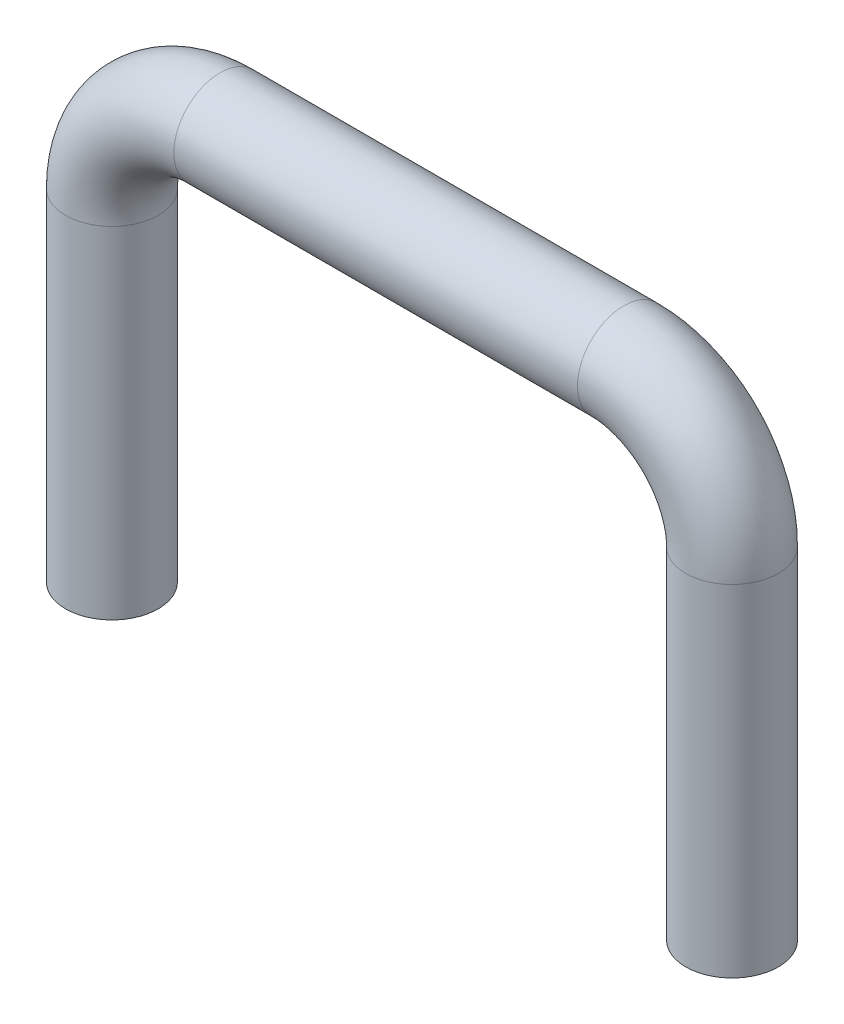
ISO-10303-21;
HEADER;
FILE_DESCRIPTION(('STEP AP214'),'2;1');
FILE_NAME('part.step','',(''),(''),'','','');
FILE_SCHEMA(('AUTOMOTIVE_DESIGN { 1 0 10303 214 1 1 1 1 }'));
ENDSEC;
DATA;
#1=APPLICATION_CONTEXT('core data for automotive mechanical design processes');
#2=APPLICATION_PROTOCOL_DEFINITION('international standard','automotive_design',2000,#1);
#3=PRODUCT_CONTEXT('',#1,'mechanical');
#4=PRODUCT('Part','Part','',(#3));
#5=PRODUCT_RELATED_PRODUCT_CATEGORY('part','',(#4));
#6=PRODUCT_DEFINITION_FORMATION('','',#4);
#7=PRODUCT_DEFINITION_CONTEXT('part definition',#1,'design');
#8=PRODUCT_DEFINITION('design','',#6,#7);
#9=PRODUCT_DEFINITION_SHAPE('','',#8);
#10=(LENGTH_UNIT() NAMED_UNIT(*) SI_UNIT(.MILLI.,.METRE.));
#11=(NAMED_UNIT(*) PLANE_ANGLE_UNIT() SI_UNIT($,.RADIAN.));
#12=(NAMED_UNIT(*) SI_UNIT($,.STERADIAN.) SOLID_ANGLE_UNIT());
#13=UNCERTAINTY_MEASURE_WITH_UNIT(LENGTH_MEASURE(1.E-05),#10,'distance_accuracy_value','');
#14=(GEOMETRIC_REPRESENTATION_CONTEXT(3) GLOBAL_UNCERTAINTY_ASSIGNED_CONTEXT((#13)) GLOBAL_UNIT_ASSIGNED_CONTEXT((#10,
#11,#12)) REPRESENTATION_CONTEXT('',''));
#15=CARTESIAN_POINT('',(0.,0.,0.));
#16=DIRECTION('',(0.,0.,1.));
#17=DIRECTION('',(1.,0.,0.));
#18=AXIS2_PLACEMENT_3D('',#15,#16,#17);
#19=CARTESIAN_POINT('',(-15.8999,0.,0.));
#20=DIRECTION('',(0.,1.,0.));
#21=DIRECTION('',(0.,0.,1.));
#22=AXIS2_PLACEMENT_3D('',#19,#20,#21);
#23=PLANE('',#22);
#24=CARTESIAN_POINT('',(-15.8999,0.,0.));
#25=DIRECTION('',(0.,1.,0.));
#26=DIRECTION('',(0.,0.,1.));
#27=AXIS2_PLACEMENT_3D('',#24,#25,#26);
#28=CIRCLE('',#27,2.3749);
#29=CARTESIAN_POINT('',(-15.8999,0.,2.3749));
#30=VERTEX_POINT('',#29);
#31=EDGE_CURVE('E45',#30,#30,#28,.T.);
#32=ORIENTED_EDGE('',*,*,#31,.F.);
#33=EDGE_LOOP('',(#32));
#34=FACE_BOUND('',#33,.T.);
#35=ADVANCED_FACE('F33',(#34),#23,.F.);
#36=CARTESIAN_POINT('',(-15.8999,0.,0.));
#37=DIRECTION('',(0.,1.,0.));
#38=DIRECTION('',(0.,0.,1.));
#39=AXIS2_PLACEMENT_3D('',#36,#37,#38);
#40=CYLINDRICAL_SURFACE('',#39,2.3749);
#41=CARTESIAN_POINT('',(-15.8999,17.4752,0.));
#42=DIRECTION('',(0.,1.,0.));
#43=DIRECTION('',(0.,0.,1.));
#44=AXIS2_PLACEMENT_3D('',#41,#42,#43);
#45=CIRCLE('',#44,2.3749);
#46=CARTESIAN_POINT('',(-18.2748,17.4752,0.));
#47=VERTEX_POINT('',#46);
#48=EDGE_CURVE('E40',#47,#47,#45,.T.);
#49=ORIENTED_EDGE('',*,*,#48,.F.);
#50=EDGE_LOOP('',(#49));
#51=FACE_BOUND('',#50,.T.);
#52=ORIENTED_EDGE('',*,*,#31,.T.);
#53=EDGE_LOOP('',(#52));
#54=FACE_BOUND('',#53,.T.);
#55=ADVANCED_FACE('F65',(#51,#54),#40,.T.);
#56=CARTESIAN_POINT('',(-10.35,17.4752,0.));
#57=DIRECTION('',(0.,0.,-1.));
#58=DIRECTION('',(-1.,0.,0.));
#59=AXIS2_PLACEMENT_3D('',#56,#57,#58);
#60=TOROIDAL_SURFACE('',#59,5.54990000000001,2.3749);
#61=CARTESIAN_POINT('',(-10.35,23.0251,0.));
#62=DIRECTION('',(1.,0.,0.));
#63=DIRECTION('',(0.,0.,1.));
#64=AXIS2_PLACEMENT_3D('',#61,#62,#63);
#65=CIRCLE('',#64,2.3749);
#66=CARTESIAN_POINT('',(-10.35,25.4,0.));
#67=VERTEX_POINT('',#66);
#68=EDGE_CURVE('E11',#67,#67,#65,.T.);
#69=CARTESIAN_POINT('',(-10.35,17.4752,0.));
#70=DIRECTION('',(0.,0.,-1.));
#71=DIRECTION('',(-1.,0.,0.));
#72=AXIS2_PLACEMENT_3D('',#69,#70,#71);
#73=CIRCLE('',#72,7.9248);
#74=EDGE_CURVE('',#47,#67,#73,.T.);
#75=ORIENTED_EDGE('',*,*,#48,.T.);
#76=ORIENTED_EDGE('',*,*,#68,.F.);
#77=ORIENTED_EDGE('',*,*,#74,.T.);
#78=ORIENTED_EDGE('',*,*,#74,.F.);
#79=EDGE_LOOP('',(#75,#77,#76,#78));
#80=FACE_BOUND('',#79,.T.);
#81=ADVANCED_FACE('F63',(#80),#60,.T.);
#82=CARTESIAN_POINT('',(-10.35,23.0251,0.));
#83=DIRECTION('',(1.,0.,0.));
#84=DIRECTION('',(0.,0.,-1.));
#85=AXIS2_PLACEMENT_3D('',#82,#83,#84);
#86=CYLINDRICAL_SURFACE('',#85,2.3749);
#87=ORIENTED_EDGE('',*,*,#68,.T.);
#88=EDGE_LOOP('',(#87));
#89=FACE_BOUND('',#88,.T.);
#90=CARTESIAN_POINT('',(10.35,23.0251,0.));
#91=DIRECTION('',(1.,0.,0.));
#92=DIRECTION('',(0.,0.,1.));
#93=AXIS2_PLACEMENT_3D('',#90,#91,#92);
#94=CIRCLE('',#93,2.3749);
#95=CARTESIAN_POINT('',(10.35,25.4,0.));
#96=VERTEX_POINT('',#95);
#97=EDGE_CURVE('E55',#96,#96,#94,.T.);
#98=ORIENTED_EDGE('',*,*,#97,.F.);
#99=EDGE_LOOP('',(#98));
#100=FACE_BOUND('',#99,.T.);
#101=ADVANCED_FACE('F73',(#89,#100),#86,.T.);
#102=CARTESIAN_POINT('',(15.8999,0.,0.));
#103=DIRECTION('',(0.,1.,0.));
#104=DIRECTION('',(0.,0.,1.));
#105=AXIS2_PLACEMENT_3D('',#102,#103,#104);
#106=PLANE('',#105);
#107=CARTESIAN_POINT('',(15.8999,0.,0.));
#108=DIRECTION('',(0.,-1.,0.));
#109=DIRECTION('',(0.,0.,1.));
#110=AXIS2_PLACEMENT_3D('',#107,#108,#109);
#111=CIRCLE('',#110,2.3749);
#112=CARTESIAN_POINT('',(15.8999,0.,2.3749));
#113=VERTEX_POINT('',#112);
#114=EDGE_CURVE('E49',#113,#113,#111,.T.);
#115=ORIENTED_EDGE('',*,*,#114,.T.);
#116=EDGE_LOOP('',(#115));
#117=FACE_BOUND('',#116,.T.);
#118=ADVANCED_FACE('F50',(#117),#106,.F.);
#119=CARTESIAN_POINT('',(15.8999,0.,0.));
#120=DIRECTION('',(0.,1.,0.));
#121=DIRECTION('',(0.,0.,1.));
#122=AXIS2_PLACEMENT_3D('',#119,#120,#121);
#123=CYLINDRICAL_SURFACE('',#122,2.3749);
#124=CARTESIAN_POINT('',(15.8999,17.4752,0.));
#125=DIRECTION('',(0.,-1.,0.));
#126=DIRECTION('',(0.,0.,1.));
#127=AXIS2_PLACEMENT_3D('',#124,#125,#126);
#128=CIRCLE('',#127,2.3749);
#129=CARTESIAN_POINT('',(18.2748,17.4752,0.));
#130=VERTEX_POINT('',#129);
#131=EDGE_CURVE('E52',#130,#130,#128,.T.);
#132=ORIENTED_EDGE('',*,*,#131,.T.);
#133=EDGE_LOOP('',(#132));
#134=FACE_BOUND('',#133,.T.);
#135=ORIENTED_EDGE('',*,*,#114,.F.);
#136=EDGE_LOOP('',(#135));
#137=FACE_BOUND('',#136,.T.);
#138=ADVANCED_FACE('F82',(#134,#137),#123,.T.);
#139=CARTESIAN_POINT('',(10.35,17.4752,0.));
#140=DIRECTION('',(0.,0.,-1.));
#141=DIRECTION('',(1.,0.,0.));
#142=AXIS2_PLACEMENT_3D('',#139,#140,#141);
#143=TOROIDAL_SURFACE('',#142,5.54990000000001,2.3749);
#144=CARTESIAN_POINT('',(10.35,17.4752,0.));
#145=DIRECTION('',(0.,0.,-1.));
#146=DIRECTION('',(1.,0.,0.));
#147=AXIS2_PLACEMENT_3D('',#144,#145,#146);
#148=CIRCLE('',#147,7.9248);
#149=EDGE_CURVE('',#96,#130,#148,.T.);
#150=ORIENTED_EDGE('',*,*,#97,.T.);
#151=ORIENTED_EDGE('',*,*,#131,.F.);
#152=ORIENTED_EDGE('',*,*,#149,.T.);
#153=ORIENTED_EDGE('',*,*,#149,.F.);
#154=EDGE_LOOP('',(#150,#152,#151,#153));
#155=FACE_BOUND('',#154,.T.);
#156=ADVANCED_FACE('F87',(#155),#143,.T.);
#157=CLOSED_SHELL('',(#35,#55,#81,#101,#118,#138,#156));
#158=MANIFOLD_SOLID_BREP('B2',#157);
#159=ADVANCED_BREP_SHAPE_REPRESENTATION('',(#18,#158),#14);
#160=SHAPE_DEFINITION_REPRESENTATION(#9,#159);
ENDSEC;
END-ISO-10303-21;
